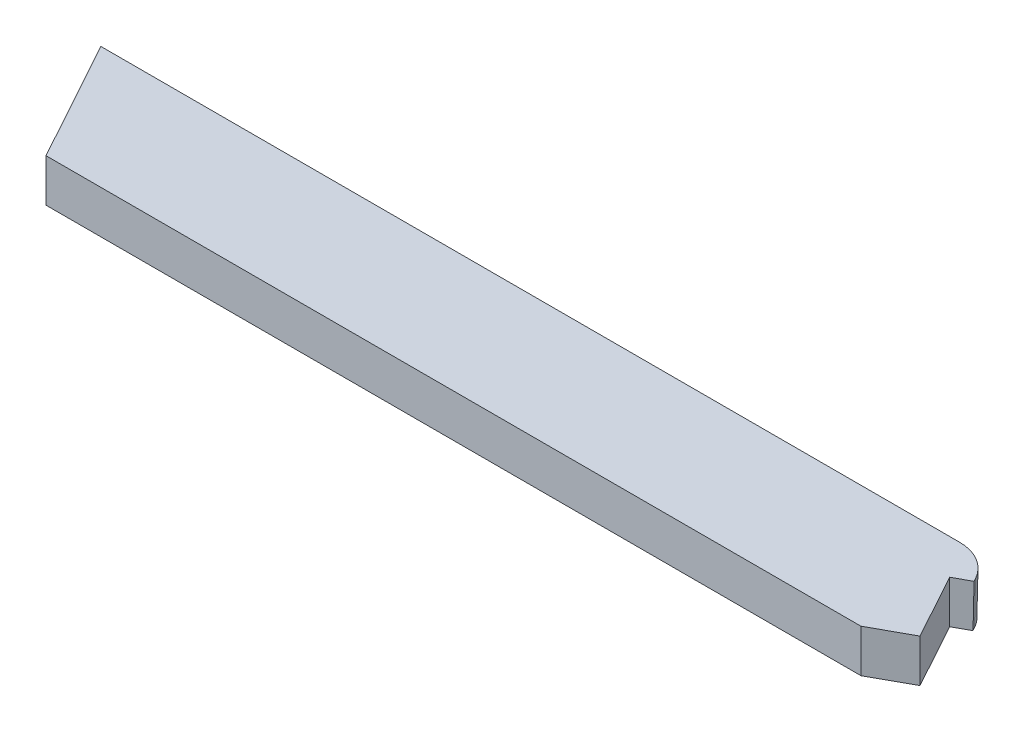
ISO-10303-21;
HEADER;
FILE_DESCRIPTION(('STEP AP214'),'2;1');
FILE_NAME('part.step','',(''),(''),'','','');
FILE_SCHEMA(('AUTOMOTIVE_DESIGN { 1 0 10303 214 1 1 1 1 }'));
ENDSEC;
DATA;
#1=APPLICATION_CONTEXT('core data for automotive mechanical design processes');
#2=APPLICATION_PROTOCOL_DEFINITION('international standard','automotive_design',2000,#1);
#3=PRODUCT_CONTEXT('',#1,'mechanical');
#4=PRODUCT('Part','Part','',(#3));
#5=PRODUCT_RELATED_PRODUCT_CATEGORY('part','',(#4));
#6=PRODUCT_DEFINITION_FORMATION('','',#4);
#7=PRODUCT_DEFINITION_CONTEXT('part definition',#1,'design');
#8=PRODUCT_DEFINITION('design','',#6,#7);
#9=PRODUCT_DEFINITION_SHAPE('','',#8);
#10=(LENGTH_UNIT() NAMED_UNIT(*) SI_UNIT(.MILLI.,.METRE.));
#11=(NAMED_UNIT(*) PLANE_ANGLE_UNIT() SI_UNIT($,.RADIAN.));
#12=(NAMED_UNIT(*) SI_UNIT($,.STERADIAN.) SOLID_ANGLE_UNIT());
#13=UNCERTAINTY_MEASURE_WITH_UNIT(LENGTH_MEASURE(1.E-05),#10,'distance_accuracy_value','');
#14=(GEOMETRIC_REPRESENTATION_CONTEXT(3) GLOBAL_UNCERTAINTY_ASSIGNED_CONTEXT((#13)) GLOBAL_UNIT_ASSIGNED_CONTEXT((#10,
#11,#12)) REPRESENTATION_CONTEXT('',''));
#15=CARTESIAN_POINT('',(0.,0.,0.));
#16=DIRECTION('',(0.,0.,1.));
#17=DIRECTION('',(1.,0.,0.));
#18=AXIS2_PLACEMENT_3D('',#15,#16,#17);
#19=CARTESIAN_POINT('',(103.199864897566,5.,-28.46));
#20=DIRECTION('',(0.,-0.0174524064372835,-0.999847695156391));
#21=DIRECTION('',(0.,-0.999847695156391,0.0174524064372835));
#22=AXIS2_PLACEMENT_3D('',#19,#20,#21);
#23=PLANE('',#22);
#24=DIRECTION('',(-1.,0.,0.));
#25=VECTOR('',#24,1.);
#26=CARTESIAN_POINT('',(0.,0.,-28.3727246753589));
#27=LINE('',#26,#25);
#28=CARTESIAN_POINT('',(0.0480593906762253,0.,-28.3727246753589));
#29=VERTEX_POINT('',#28);
#30=CARTESIAN_POINT('',(100.097496592042,0.,-28.3727246753589));
#31=VERTEX_POINT('',#30);
#32=EDGE_CURVE('E128',#29,#31,#27,.F.);
#33=ORIENTED_EDGE('',*,*,#32,.F.);
#34=DIRECTION('',(-0.00960997042116783,0.999801525357449,-0.0174516005404453));
#35=VECTOR('',#34,1.);
#36=CARTESIAN_POINT('',(0.00953066557345165,4.00844918762604,-28.4426924161904));
#37=LINE('',#36,#35);
#38=CARTESIAN_POINT('',(0.,5.,-28.46));
#39=VERTEX_POINT('',#38);
#40=EDGE_CURVE('E134',#39,#29,#37,.F.);
#41=ORIENTED_EDGE('',*,*,#40,.F.);
#42=DIRECTION('',(1.,0.,0.));
#43=VECTOR('',#42,1.);
#44=CARTESIAN_POINT('',(103.199864897566,5.,-28.46));
#45=LINE('',#44,#43);
#46=CARTESIAN_POINT('',(100.097496592042,5.,-28.46));
#47=VERTEX_POINT('',#46);
#48=EDGE_CURVE('E126',#39,#47,#45,.T.);
#49=ORIENTED_EDGE('',*,*,#48,.T.);
#50=DIRECTION('',(0.,0.999847695156391,-0.0174524064372835));
#51=VECTOR('',#50,1.);
#52=CARTESIAN_POINT('',(100.097496592042,5.,-28.46));
#53=LINE('',#52,#51);
#54=EDGE_CURVE('E41',#31,#47,#53,.T.);
#55=ORIENTED_EDGE('',*,*,#54,.F.);
#56=EDGE_LOOP('',(#33,#41,#49,#55));
#57=FACE_BOUND('',#56,.T.);
#58=ADVANCED_FACE('F31',(#57),#23,.T.);
#59=CARTESIAN_POINT('',(111.035815461315,5.,-14.23));
#60=DIRECTION('',(0.875836724513673,-0.0174524064372835,-0.482291867547763));
#61=DIRECTION('',(0.482365334124539,0.,0.8759701390087));
#62=AXIS2_PLACEMENT_3D('',#59,#60,#61);
#63=PLANE('',#62);
#64=DIRECTION('',(0.482365334124539,0.,0.8759701390087));
#65=VECTOR('',#64,1.);
#66=CARTESIAN_POINT('',(111.035815461315,5.,-14.23));
#67=LINE('',#66,#65);
#68=CARTESIAN_POINT('',(104.696339821838,5.,-25.7424180041538));
#69=VERTEX_POINT('',#68);
#70=CARTESIAN_POINT('',(104.909775717933,5.,-25.3548207654105));
#71=VERTEX_POINT('',#70);
#72=EDGE_CURVE('E164',#69,#71,#67,.T.);
#73=ORIENTED_EDGE('',*,*,#72,.T.);
#74=DIRECTION('',(-0.0152877868929036,-0.999847695156391,0.00841843586239755));
#75=VECTOR('',#74,1.);
#76=CARTESIAN_POINT('',(104.909775717933,5.,-25.3548207654105));
#77=LINE('',#76,#75);
#78=CARTESIAN_POINT('',(104.833325139675,0.,-25.3127221742792));
#79=VERTEX_POINT('',#78);
#80=EDGE_CURVE('E138',#79,#71,#77,.F.);
#81=ORIENTED_EDGE('',*,*,#80,.F.);
#82=DIRECTION('',(-0.482365334124539,0.,-0.8759701390087));
#83=VECTOR('',#82,1.);
#84=CARTESIAN_POINT('',(79.1112499881286,0.,-72.023727613727));
#85=LINE('',#84,#83);
#86=CARTESIAN_POINT('',(104.61988924358,0.,-25.7003194130225));
#87=VERTEX_POINT('',#86);
#88=EDGE_CURVE('E124',#87,#79,#85,.F.);
#89=ORIENTED_EDGE('',*,*,#88,.F.);
#90=DIRECTION('',(0.0152877868929036,0.999847695156391,-0.00841843586239754));
#91=VECTOR('',#90,1.);
#92=CARTESIAN_POINT('',(104.696339821838,5.,-25.7424180041538));
#93=LINE('',#92,#91);
#94=EDGE_CURVE('E35',#69,#87,#93,.F.);
#95=ORIENTED_EDGE('',*,*,#94,.F.);
#96=EDGE_LOOP('',(#73,#81,#89,#95));
#97=FACE_BOUND('',#96,.T.);
#98=ADVANCED_FACE('F150',(#97),#63,.T.);
#99=CARTESIAN_POINT('',(7.83595056374863,5.,-14.23));
#100=DIRECTION('',(0.,0.,-1.));
#101=DIRECTION('',(1.,0.,0.));
#102=AXIS2_PLACEMENT_3D('',#99,#100,#101);
#103=PLANE('',#102);
#104=DIRECTION('',(-1.,0.,0.));
#105=VECTOR('',#104,1.);
#106=CARTESIAN_POINT('',(7.83595056374863,5.,-14.23));
#107=LINE('',#106,#105);
#108=CARTESIAN_POINT('',(102.847001463789,5.,-14.23));
#109=VERTEX_POINT('',#108);
#110=CARTESIAN_POINT('',(7.83595056374863,5.,-14.23));
#111=VERTEX_POINT('',#110);
#112=EDGE_CURVE('E165',#109,#111,#107,.T.);
#113=ORIENTED_EDGE('',*,*,#112,.T.);
#114=DIRECTION('',(0.,-1.,0.));
#115=VECTOR('',#114,1.);
#116=CARTESIAN_POINT('',(7.83595056374863,5.,-14.23));
#117=LINE('',#116,#115);
#118=CARTESIAN_POINT('',(7.83595056374863,0.,-14.23));
#119=VERTEX_POINT('',#118);
#120=EDGE_CURVE('E122',#111,#119,#117,.T.);
#121=ORIENTED_EDGE('',*,*,#120,.T.);
#122=DIRECTION('',(-1.,0.,0.));
#123=VECTOR('',#122,1.);
#124=CARTESIAN_POINT('',(7.83595056374863,0.,-14.23));
#125=LINE('',#124,#123);
#126=CARTESIAN_POINT('',(102.847001463789,0.,-14.2299999999999));
#127=VERTEX_POINT('',#126);
#128=EDGE_CURVE('E105',#127,#119,#125,.T.);
#129=ORIENTED_EDGE('',*,*,#128,.F.);
#130=DIRECTION('',(0.,1.,0.));
#131=VECTOR('',#130,1.);
#132=CARTESIAN_POINT('',(102.847001463789,-0.00100000000000013,-14.23));
#133=LINE('',#132,#131);
#134=EDGE_CURVE('E112',#127,#109,#133,.T.);
#135=ORIENTED_EDGE('',*,*,#134,.T.);
#136=EDGE_LOOP('',(#113,#121,#129,#135));
#137=FACE_BOUND('',#136,.T.);
#138=ADVANCED_FACE('F120',(#137),#103,.F.);
#139=CARTESIAN_POINT('',(0.,5.,-28.46));
#140=DIRECTION('',(0.8759701390087,0.,-0.482365334124539));
#141=DIRECTION('',(0.482365334124539,0.,0.8759701390087));
#142=AXIS2_PLACEMENT_3D('',#139,#140,#141);
#143=PLANE('',#142);
#144=DIRECTION('',(-0.482365334124539,0.,-0.8759701390087));
#145=VECTOR('',#144,1.);
#146=CARTESIAN_POINT('',(0.,0.,-28.46));
#147=LINE('',#146,#145);
#148=EDGE_CURVE('E123',#119,#29,#147,.T.);
#149=ORIENTED_EDGE('',*,*,#148,.F.);
#150=ORIENTED_EDGE('',*,*,#120,.F.);
#151=DIRECTION('',(-0.482365334124539,0.,-0.8759701390087));
#152=VECTOR('',#151,1.);
#153=CARTESIAN_POINT('',(0.,5.,-28.46));
#154=LINE('',#153,#152);
#155=EDGE_CURVE('E131',#111,#39,#154,.T.);
#156=ORIENTED_EDGE('',*,*,#155,.T.);
#157=ORIENTED_EDGE('',*,*,#40,.T.);
#158=EDGE_LOOP('',(#149,#150,#156,#157));
#159=FACE_BOUND('',#158,.T.);
#160=ADVANCED_FACE('F167',(#159),#143,.F.);
#161=CARTESIAN_POINT('',(0.,5.,-28.46));
#162=DIRECTION('',(0.,-1.,0.));
#163=DIRECTION('',(0.,0.,1.));
#164=AXIS2_PLACEMENT_3D('',#161,#162,#163);
#165=PLANE('',#164);
#166=ORIENTED_EDGE('',*,*,#48,.F.);
#167=ORIENTED_EDGE('',*,*,#155,.F.);
#168=ORIENTED_EDGE('',*,*,#112,.F.);
#169=DIRECTION('',(0.8759701390087,0.,-0.48236533412454));
#170=VECTOR('',#169,1.);
#171=CARTESIAN_POINT('',(107.290935099604,5.,-16.6771148474228));
#172=LINE('',#171,#170);
#173=CARTESIAN_POINT('',(107.290935099604,5.,-16.6771148474228));
#174=VERTEX_POINT('',#173);
#175=EDGE_CURVE('E115',#109,#174,#172,.T.);
#176=ORIENTED_EDGE('',*,*,#175,.T.);
#177=DIRECTION('',(-0.482365334124539,0.,-0.875970139008701));
#178=VECTOR('',#177,1.);
#179=CARTESIAN_POINT('',(108.638473467013,5.,-14.23));
#180=LINE('',#179,#178);
#181=CARTESIAN_POINT('',(103.070238426015,5.,-24.3418535637489));
#182=VERTEX_POINT('',#181);
#183=EDGE_CURVE('E153',#174,#182,#180,.T.);
#184=ORIENTED_EDGE('',*,*,#183,.T.);
#185=DIRECTION('',(0.8759701390087,0.,-0.48236533412454));
#186=VECTOR('',#185,1.);
#187=CARTESIAN_POINT('',(104.909775717933,5.,-25.3548207654105));
#188=LINE('',#187,#186);
#189=EDGE_CURVE('E156',#182,#71,#188,.T.);
#190=ORIENTED_EDGE('',*,*,#189,.T.);
#191=ORIENTED_EDGE('',*,*,#72,.F.);
#192=CARTESIAN_POINT('',(100.097496592042,5.,-23.21));
#193=DIRECTION('',(0.,1.,0.));
#194=DIRECTION('',(0.,0.,1.));
#195=AXIS2_PLACEMENT_3D('',#192,#193,#194);
#196=CIRCLE('',#195,5.25);
#197=EDGE_CURVE('E11',#47,#69,#196,.F.);
#198=ORIENTED_EDGE('',*,*,#197,.F.);
#199=EDGE_LOOP('',(#166,#167,#168,#176,#184,#190,#191,#198));
#200=FACE_BOUND('',#199,.T.);
#201=ADVANCED_FACE('F170',(#200),#165,.F.);
#202=CARTESIAN_POINT('',(0.,0.,-28.46));
#203=DIRECTION('',(0.,-1.,0.));
#204=DIRECTION('',(0.,0.,1.));
#205=AXIS2_PLACEMENT_3D('',#202,#203,#204);
#206=PLANE('',#205);
#207=ORIENTED_EDGE('',*,*,#88,.T.);
#208=DIRECTION('',(0.8759701390087,0.,-0.48236533412454));
#209=VECTOR('',#208,1.);
#210=CARTESIAN_POINT('',(104.909775717933,0.,-25.3548207654105));
#211=LINE('',#210,#209);
#212=CARTESIAN_POINT('',(103.070238426015,0.,-24.341853563749));
#213=VERTEX_POINT('',#212);
#214=EDGE_CURVE('E151',#213,#79,#211,.T.);
#215=ORIENTED_EDGE('',*,*,#214,.F.);
#216=DIRECTION('',(-0.482365334124539,0.,-0.875970139008701));
#217=VECTOR('',#216,1.);
#218=CARTESIAN_POINT('',(108.638473467013,0.,-14.23));
#219=LINE('',#218,#217);
#220=CARTESIAN_POINT('',(107.290935099604,0.,-16.6771148474228));
#221=VERTEX_POINT('',#220);
#222=EDGE_CURVE('E109',#221,#213,#219,.T.);
#223=ORIENTED_EDGE('',*,*,#222,.F.);
#224=DIRECTION('',(0.8759701390087,0.,-0.48236533412454));
#225=VECTOR('',#224,1.);
#226=CARTESIAN_POINT('',(107.290935099604,0.,-16.6771148474228));
#227=LINE('',#226,#225);
#228=EDGE_CURVE('E101',#127,#221,#227,.T.);
#229=ORIENTED_EDGE('',*,*,#228,.F.);
#230=ORIENTED_EDGE('',*,*,#128,.T.);
#231=ORIENTED_EDGE('',*,*,#148,.T.);
#232=ORIENTED_EDGE('',*,*,#32,.T.);
#233=CARTESIAN_POINT('',(100.097496592042,0.,-23.21));
#234=DIRECTION('',(0.,1.,0.));
#235=DIRECTION('',(0.,0.,1.));
#236=AXIS2_PLACEMENT_3D('',#233,#234,#235);
#237=CIRCLE('',#236,5.16272467535891);
#238=EDGE_CURVE('E69',#87,#31,#237,.T.);
#239=ORIENTED_EDGE('',*,*,#238,.F.);
#240=EDGE_LOOP('',(#207,#215,#223,#229,#230,#231,#232,#239));
#241=FACE_BOUND('',#240,.T.);
#242=ADVANCED_FACE('F103',(#241),#206,.T.);
#243=CARTESIAN_POINT('',(104.909775717933,-0.00100000000000013,-25.3548207654105));
#244=DIRECTION('',(-0.48236533412454,0.,-0.8759701390087));
#245=DIRECTION('',(0.8759701390087,0.,-0.48236533412454));
#246=AXIS2_PLACEMENT_3D('',#243,#244,#245);
#247=PLANE('',#246);
#248=DIRECTION('',(0.,1.,0.));
#249=VECTOR('',#248,1.);
#250=CARTESIAN_POINT('',(103.070238426015,-0.00100000000000013,-24.3418535637489));
#251=LINE('',#250,#249);
#252=EDGE_CURVE('E142',#213,#182,#251,.T.);
#253=ORIENTED_EDGE('',*,*,#252,.F.);
#254=ORIENTED_EDGE('',*,*,#214,.T.);
#255=ORIENTED_EDGE('',*,*,#80,.T.);
#256=ORIENTED_EDGE('',*,*,#189,.F.);
#257=EDGE_LOOP('',(#253,#254,#255,#256));
#258=FACE_BOUND('',#257,.T.);
#259=ADVANCED_FACE('F184',(#258),#247,.F.);
#260=CARTESIAN_POINT('',(108.638473467013,-0.00100000000000013,-14.23));
#261=DIRECTION('',(-0.875970139008701,0.,0.482365334124538));
#262=DIRECTION('',(-0.482365334124539,0.,-0.875970139008701));
#263=AXIS2_PLACEMENT_3D('',#260,#261,#262);
#264=PLANE('',#263);
#265=ORIENTED_EDGE('',*,*,#222,.T.);
#266=ORIENTED_EDGE('',*,*,#252,.T.);
#267=ORIENTED_EDGE('',*,*,#183,.F.);
#268=DIRECTION('',(0.,1.,0.));
#269=VECTOR('',#268,1.);
#270=CARTESIAN_POINT('',(107.290935099604,-0.00100000000000013,-16.6771148474228));
#271=LINE('',#270,#269);
#272=EDGE_CURVE('E77',#221,#174,#271,.T.);
#273=ORIENTED_EDGE('',*,*,#272,.F.);
#274=EDGE_LOOP('',(#265,#266,#267,#273));
#275=FACE_BOUND('',#274,.T.);
#276=ADVANCED_FACE('F187',(#275),#264,.F.);
#277=CARTESIAN_POINT('',(107.290935099604,-0.00100000000000013,-16.6771148474228));
#278=DIRECTION('',(-0.48236533412454,0.,-0.8759701390087));
#279=DIRECTION('',(0.8759701390087,0.,-0.48236533412454));
#280=AXIS2_PLACEMENT_3D('',#277,#278,#279);
#281=PLANE('',#280);
#282=ORIENTED_EDGE('',*,*,#134,.F.);
#283=ORIENTED_EDGE('',*,*,#228,.T.);
#284=ORIENTED_EDGE('',*,*,#272,.T.);
#285=ORIENTED_EDGE('',*,*,#175,.F.);
#286=EDGE_LOOP('',(#282,#283,#284,#285));
#287=FACE_BOUND('',#286,.T.);
#288=ADVANCED_FACE('F113',(#287),#281,.F.);
#289=CARTESIAN_POINT('',(100.097496592042,5.,-23.21));
#290=DIRECTION('',(0.,1.,0.));
#291=DIRECTION('',(0.,0.,1.));
#292=AXIS2_PLACEMENT_3D('',#289,#290,#291);
#293=CONICAL_SURFACE('',#292,5.25,0.0174532925199433);
#294=ORIENTED_EDGE('',*,*,#197,.T.);
#295=ORIENTED_EDGE('',*,*,#94,.T.);
#296=ORIENTED_EDGE('',*,*,#238,.T.);
#297=ORIENTED_EDGE('',*,*,#54,.T.);
#298=EDGE_LOOP('',(#294,#295,#296,#297));
#299=FACE_BOUND('',#298,.T.);
#300=ADVANCED_FACE('F33',(#299),#293,.T.);
#301=CLOSED_SHELL('',(#58,#98,#138,#160,#201,#242,#259,#276,#288,#300));
#302=MANIFOLD_SOLID_BREP('B2',#301);
#303=ADVANCED_BREP_SHAPE_REPRESENTATION('',(#18,#302),#14);
#304=SHAPE_DEFINITION_REPRESENTATION(#9,#303);
ENDSEC;
END-ISO-10303-21;
